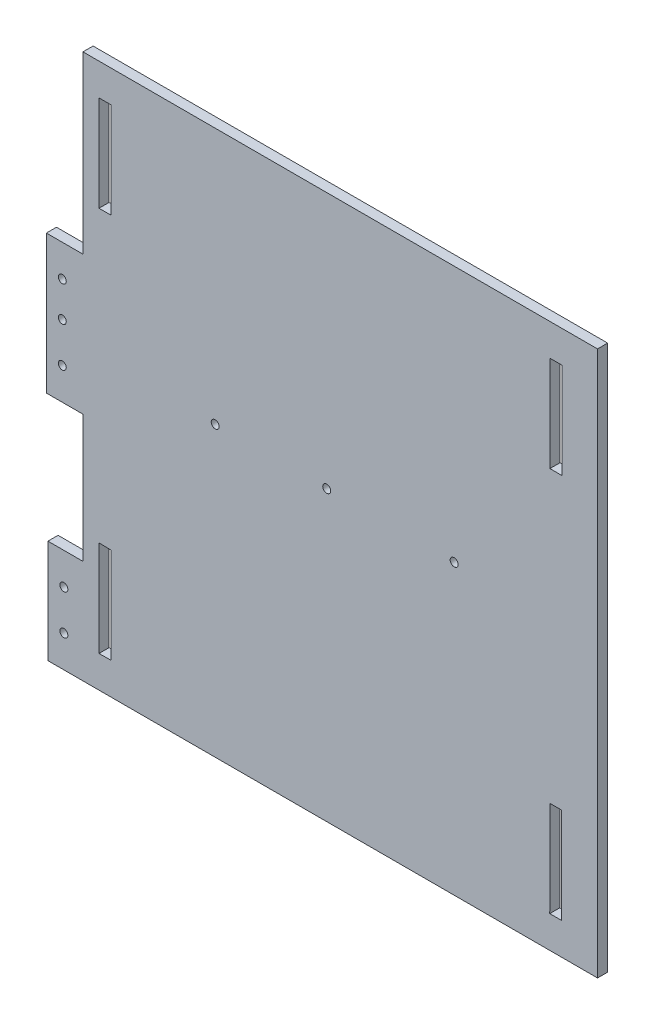
ISO-10303-21;
HEADER;
FILE_DESCRIPTION(('STEP AP214'),'2;1');
FILE_NAME('part.step','',(''),(''),'','','');
FILE_SCHEMA(('AUTOMOTIVE_DESIGN { 1 0 10303 214 1 1 1 1 }'));
ENDSEC;
DATA;
#1=APPLICATION_CONTEXT('core data for automotive mechanical design processes');
#2=APPLICATION_PROTOCOL_DEFINITION('international standard','automotive_design',2000,#1);
#3=PRODUCT_CONTEXT('',#1,'mechanical');
#4=PRODUCT('Part','Part','',(#3));
#5=PRODUCT_RELATED_PRODUCT_CATEGORY('part','',(#4));
#6=PRODUCT_DEFINITION_FORMATION('','',#4);
#7=PRODUCT_DEFINITION_CONTEXT('part definition',#1,'design');
#8=PRODUCT_DEFINITION('design','',#6,#7);
#9=PRODUCT_DEFINITION_SHAPE('','',#8);
#10=(LENGTH_UNIT() NAMED_UNIT(*) SI_UNIT(.MILLI.,.METRE.));
#11=(NAMED_UNIT(*) PLANE_ANGLE_UNIT() SI_UNIT($,.RADIAN.));
#12=(NAMED_UNIT(*) SI_UNIT($,.STERADIAN.) SOLID_ANGLE_UNIT());
#13=UNCERTAINTY_MEASURE_WITH_UNIT(LENGTH_MEASURE(1.E-05),#10,'distance_accuracy_value','');
#14=(GEOMETRIC_REPRESENTATION_CONTEXT(3) GLOBAL_UNCERTAINTY_ASSIGNED_CONTEXT((#13)) GLOBAL_UNIT_ASSIGNED_CONTEXT((#10,
#11,#12)) REPRESENTATION_CONTEXT('',''));
#15=CARTESIAN_POINT('',(0.,0.,0.));
#16=DIRECTION('',(0.,0.,1.));
#17=DIRECTION('',(1.,0.,0.));
#18=AXIS2_PLACEMENT_3D('',#15,#16,#17);
#19=CARTESIAN_POINT('',(691.84061693696,302.611489719056,-6.35));
#20=DIRECTION('',(1.,0.,0.));
#21=DIRECTION('',(0.,0.,-1.));
#22=AXIS2_PLACEMENT_3D('',#19,#20,#21);
#23=PLANE('',#22);
#24=DIRECTION('',(0.,1.,0.));
#25=VECTOR('',#24,1.);
#26=CARTESIAN_POINT('',(691.84061693696,302.611489719056,0.));
#27=LINE('',#26,#25);
#28=CARTESIAN_POINT('',(691.84061693696,302.611489719056,0.));
#29=VERTEX_POINT('',#28);
#30=CARTESIAN_POINT('',(691.84061693696,644.611489719056,0.));
#31=VERTEX_POINT('',#30);
#32=EDGE_CURVE('E388',#29,#31,#27,.T.);
#33=ORIENTED_EDGE('',*,*,#32,.F.);
#34=DIRECTION('',(0.,0.,1.));
#35=VECTOR('',#34,1.);
#36=CARTESIAN_POINT('',(691.84061693696,302.611489719056,-6.35));
#37=LINE('',#36,#35);
#38=CARTESIAN_POINT('',(691.84061693696,302.611489719056,-6.35));
#39=VERTEX_POINT('',#38);
#40=EDGE_CURVE('E11',#39,#29,#37,.T.);
#41=ORIENTED_EDGE('',*,*,#40,.F.);
#42=DIRECTION('',(0.,1.,0.));
#43=VECTOR('',#42,1.);
#44=CARTESIAN_POINT('',(691.84061693696,302.611489719056,-6.35));
#45=LINE('',#44,#43);
#46=CARTESIAN_POINT('',(691.84061693696,644.611489719056,-6.35));
#47=VERTEX_POINT('',#46);
#48=EDGE_CURVE('E391',#39,#47,#45,.T.);
#49=ORIENTED_EDGE('',*,*,#48,.T.);
#50=DIRECTION('',(0.,0.,1.));
#51=VECTOR('',#50,1.);
#52=CARTESIAN_POINT('',(691.84061693696,644.611489719056,-6.35));
#53=LINE('',#52,#51);
#54=EDGE_CURVE('E40',#47,#31,#53,.T.);
#55=ORIENTED_EDGE('',*,*,#54,.T.);
#56=EDGE_LOOP('',(#33,#41,#49,#55));
#57=FACE_BOUND('',#56,.T.);
#58=ADVANCED_FACE('F37',(#57),#23,.T.);
#59=CARTESIAN_POINT('',(691.84061693696,302.611489719056,-6.35));
#60=DIRECTION('',(0.,-1.,0.));
#61=DIRECTION('',(1.,0.,0.));
#62=AXIS2_PLACEMENT_3D('',#59,#60,#61);
#63=PLANE('',#62);
#64=DIRECTION('',(1.,0.,0.));
#65=VECTOR('',#64,1.);
#66=CARTESIAN_POINT('',(691.84061693696,302.611489719056,0.));
#67=LINE('',#66,#65);
#68=CARTESIAN_POINT('',(346.84061693696,302.611489719056,0.));
#69=VERTEX_POINT('',#68);
#70=EDGE_CURVE('E395',#69,#29,#67,.T.);
#71=ORIENTED_EDGE('',*,*,#70,.F.);
#72=DIRECTION('',(0.,0.,1.));
#73=VECTOR('',#72,1.);
#74=CARTESIAN_POINT('',(346.84061693696,302.611489719056,-6.35));
#75=LINE('',#74,#73);
#76=CARTESIAN_POINT('',(346.84061693696,302.611489719056,-6.35));
#77=VERTEX_POINT('',#76);
#78=EDGE_CURVE('E45',#77,#69,#75,.T.);
#79=ORIENTED_EDGE('',*,*,#78,.F.);
#80=DIRECTION('',(1.,0.,0.));
#81=VECTOR('',#80,1.);
#82=CARTESIAN_POINT('',(691.84061693696,302.611489719056,-6.35));
#83=LINE('',#82,#81);
#84=EDGE_CURVE('E419',#77,#39,#83,.T.);
#85=ORIENTED_EDGE('',*,*,#84,.T.);
#86=ORIENTED_EDGE('',*,*,#40,.T.);
#87=EDGE_LOOP('',(#71,#79,#85,#86));
#88=FACE_BOUND('',#87,.T.);
#89=ADVANCED_FACE('F476',(#88),#63,.T.);
#90=CARTESIAN_POINT('',(346.84061693696,302.611489719056,-6.35));
#91=DIRECTION('',(-1.,0.,0.));
#92=DIRECTION('',(0.,0.,1.));
#93=AXIS2_PLACEMENT_3D('',#90,#91,#92);
#94=PLANE('',#93);
#95=DIRECTION('',(0.,-1.,0.));
#96=VECTOR('',#95,1.);
#97=CARTESIAN_POINT('',(346.84061693696,302.611489719056,0.));
#98=LINE('',#97,#96);
#99=CARTESIAN_POINT('',(346.84061693696,367.611489719056,0.));
#100=VERTEX_POINT('',#99);
#101=EDGE_CURVE('E445',#100,#69,#98,.T.);
#102=ORIENTED_EDGE('',*,*,#101,.F.);
#103=DIRECTION('',(0.,0.,1.));
#104=VECTOR('',#103,1.);
#105=CARTESIAN_POINT('',(346.84061693696,367.611489719056,-6.35));
#106=LINE('',#105,#104);
#107=CARTESIAN_POINT('',(346.84061693696,367.611489719056,-6.35));
#108=VERTEX_POINT('',#107);
#109=EDGE_CURVE('E451',#108,#100,#106,.T.);
#110=ORIENTED_EDGE('',*,*,#109,.F.);
#111=DIRECTION('',(0.,-1.,0.));
#112=VECTOR('',#111,1.);
#113=CARTESIAN_POINT('',(346.84061693696,302.611489719056,-6.35));
#114=LINE('',#113,#112);
#115=EDGE_CURVE('E416',#108,#77,#114,.T.);
#116=ORIENTED_EDGE('',*,*,#115,.T.);
#117=ORIENTED_EDGE('',*,*,#78,.T.);
#118=EDGE_LOOP('',(#102,#110,#116,#117));
#119=FACE_BOUND('',#118,.T.);
#120=ADVANCED_FACE('F504',(#119),#94,.T.);
#121=CARTESIAN_POINT('',(346.84061693696,367.611489719056,-6.35));
#122=DIRECTION('',(0.,1.,0.));
#123=DIRECTION('',(-1.,0.,0.));
#124=AXIS2_PLACEMENT_3D('',#121,#122,#123);
#125=PLANE('',#124);
#126=DIRECTION('',(-1.,0.,0.));
#127=VECTOR('',#126,1.);
#128=CARTESIAN_POINT('',(346.84061693696,367.611489719056,0.));
#129=LINE('',#128,#127);
#130=CARTESIAN_POINT('',(368.84061693696,367.611489719056,0.));
#131=VERTEX_POINT('',#130);
#132=EDGE_CURVE('E442',#131,#100,#129,.T.);
#133=ORIENTED_EDGE('',*,*,#132,.F.);
#134=DIRECTION('',(0.,0.,1.));
#135=VECTOR('',#134,1.);
#136=CARTESIAN_POINT('',(368.84061693696,367.611489719056,-6.35));
#137=LINE('',#136,#135);
#138=CARTESIAN_POINT('',(368.84061693696,367.611489719056,-6.35));
#139=VERTEX_POINT('',#138);
#140=EDGE_CURVE('E453',#139,#131,#137,.T.);
#141=ORIENTED_EDGE('',*,*,#140,.F.);
#142=DIRECTION('',(-1.,0.,0.));
#143=VECTOR('',#142,1.);
#144=CARTESIAN_POINT('',(346.84061693696,367.611489719056,-6.35));
#145=LINE('',#144,#143);
#146=EDGE_CURVE('E413',#139,#108,#145,.T.);
#147=ORIENTED_EDGE('',*,*,#146,.T.);
#148=ORIENTED_EDGE('',*,*,#109,.T.);
#149=EDGE_LOOP('',(#133,#141,#147,#148));
#150=FACE_BOUND('',#149,.T.);
#151=ADVANCED_FACE('F502',(#150),#125,.T.);
#152=CARTESIAN_POINT('',(368.84061693696,447.611489719056,-6.35));
#153=DIRECTION('',(-1.,0.,0.));
#154=DIRECTION('',(0.,0.,1.));
#155=AXIS2_PLACEMENT_3D('',#152,#153,#154);
#156=PLANE('',#155);
#157=DIRECTION('',(0.,-1.,0.));
#158=VECTOR('',#157,1.);
#159=CARTESIAN_POINT('',(368.84061693696,447.611489719056,0.));
#160=LINE('',#159,#158);
#161=CARTESIAN_POINT('',(368.84061693696,447.611489719056,0.));
#162=VERTEX_POINT('',#161);
#163=EDGE_CURVE('E439',#162,#131,#160,.T.);
#164=ORIENTED_EDGE('',*,*,#163,.F.);
#165=DIRECTION('',(0.,0.,1.));
#166=VECTOR('',#165,1.);
#167=CARTESIAN_POINT('',(368.84061693696,447.611489719056,-6.35));
#168=LINE('',#167,#166);
#169=CARTESIAN_POINT('',(368.84061693696,447.611489719056,-6.35));
#170=VERTEX_POINT('',#169);
#171=EDGE_CURVE('E455',#170,#162,#168,.T.);
#172=ORIENTED_EDGE('',*,*,#171,.F.);
#173=DIRECTION('',(0.,-1.,0.));
#174=VECTOR('',#173,1.);
#175=CARTESIAN_POINT('',(368.84061693696,447.611489719056,-6.35));
#176=LINE('',#175,#174);
#177=EDGE_CURVE('E410',#170,#139,#176,.T.);
#178=ORIENTED_EDGE('',*,*,#177,.T.);
#179=ORIENTED_EDGE('',*,*,#140,.T.);
#180=EDGE_LOOP('',(#164,#172,#178,#179));
#181=FACE_BOUND('',#180,.T.);
#182=ADVANCED_FACE('F498',(#181),#156,.T.);
#183=CARTESIAN_POINT('',(368.84061693696,447.611489719056,-6.35));
#184=DIRECTION('',(0.,-1.,0.));
#185=DIRECTION('',(0.,0.,-1.));
#186=AXIS2_PLACEMENT_3D('',#183,#184,#185);
#187=PLANE('',#186);
#188=DIRECTION('',(1.,0.,0.));
#189=VECTOR('',#188,1.);
#190=CARTESIAN_POINT('',(368.84061693696,447.611489719056,0.));
#191=LINE('',#190,#189);
#192=CARTESIAN_POINT('',(345.84061693696,447.611489719056,0.));
#193=VERTEX_POINT('',#192);
#194=EDGE_CURVE('E436',#193,#162,#191,.T.);
#195=ORIENTED_EDGE('',*,*,#194,.F.);
#196=DIRECTION('',(0.,0.,1.));
#197=VECTOR('',#196,1.);
#198=CARTESIAN_POINT('',(345.84061693696,447.611489719056,-6.35));
#199=LINE('',#198,#197);
#200=CARTESIAN_POINT('',(345.84061693696,447.611489719056,-6.35));
#201=VERTEX_POINT('',#200);
#202=EDGE_CURVE('E457',#201,#193,#199,.T.);
#203=ORIENTED_EDGE('',*,*,#202,.F.);
#204=DIRECTION('',(1.,0.,0.));
#205=VECTOR('',#204,1.);
#206=CARTESIAN_POINT('',(368.84061693696,447.611489719056,-6.35));
#207=LINE('',#206,#205);
#208=EDGE_CURVE('E407',#201,#170,#207,.T.);
#209=ORIENTED_EDGE('',*,*,#208,.T.);
#210=ORIENTED_EDGE('',*,*,#171,.T.);
#211=EDGE_LOOP('',(#195,#203,#209,#210));
#212=FACE_BOUND('',#211,.T.);
#213=ADVANCED_FACE('F494',(#212),#187,.T.);
#214=CARTESIAN_POINT('',(345.84061693696,447.611489719056,-6.35));
#215=DIRECTION('',(-1.,0.,0.));
#216=DIRECTION('',(0.,0.,1.));
#217=AXIS2_PLACEMENT_3D('',#214,#215,#216);
#218=PLANE('',#217);
#219=DIRECTION('',(0.,-1.,0.));
#220=VECTOR('',#219,1.);
#221=CARTESIAN_POINT('',(345.84061693696,447.611489719056,0.));
#222=LINE('',#221,#220);
#223=CARTESIAN_POINT('',(345.84061693696,534.611489719056,0.));
#224=VERTEX_POINT('',#223);
#225=EDGE_CURVE('E433',#224,#193,#222,.T.);
#226=ORIENTED_EDGE('',*,*,#225,.F.);
#227=DIRECTION('',(0.,0.,1.));
#228=VECTOR('',#227,1.);
#229=CARTESIAN_POINT('',(345.84061693696,534.611489719056,-6.35));
#230=LINE('',#229,#228);
#231=CARTESIAN_POINT('',(345.84061693696,534.611489719056,-6.35));
#232=VERTEX_POINT('',#231);
#233=EDGE_CURVE('E459',#232,#224,#230,.T.);
#234=ORIENTED_EDGE('',*,*,#233,.F.);
#235=DIRECTION('',(0.,-1.,0.));
#236=VECTOR('',#235,1.);
#237=CARTESIAN_POINT('',(345.84061693696,447.611489719056,-6.35));
#238=LINE('',#237,#236);
#239=EDGE_CURVE('E404',#232,#201,#238,.T.);
#240=ORIENTED_EDGE('',*,*,#239,.T.);
#241=ORIENTED_EDGE('',*,*,#202,.T.);
#242=EDGE_LOOP('',(#226,#234,#240,#241));
#243=FACE_BOUND('',#242,.T.);
#244=ADVANCED_FACE('F490',(#243),#218,.T.);
#245=CARTESIAN_POINT('',(345.84061693696,534.611489719056,-6.35));
#246=DIRECTION('',(0.,1.,0.));
#247=DIRECTION('',(-1.,0.,0.));
#248=AXIS2_PLACEMENT_3D('',#245,#246,#247);
#249=PLANE('',#248);
#250=DIRECTION('',(-1.,0.,0.));
#251=VECTOR('',#250,1.);
#252=CARTESIAN_POINT('',(345.84061693696,534.611489719056,0.));
#253=LINE('',#252,#251);
#254=CARTESIAN_POINT('',(368.84061693696,534.611489719056,0.));
#255=VERTEX_POINT('',#254);
#256=EDGE_CURVE('E430',#255,#224,#253,.T.);
#257=ORIENTED_EDGE('',*,*,#256,.F.);
#258=DIRECTION('',(0.,0.,1.));
#259=VECTOR('',#258,1.);
#260=CARTESIAN_POINT('',(368.84061693696,534.611489719056,-6.35));
#261=LINE('',#260,#259);
#262=CARTESIAN_POINT('',(368.84061693696,534.611489719056,-6.35));
#263=VERTEX_POINT('',#262);
#264=EDGE_CURVE('E461',#263,#255,#261,.T.);
#265=ORIENTED_EDGE('',*,*,#264,.F.);
#266=DIRECTION('',(-1.,0.,0.));
#267=VECTOR('',#266,1.);
#268=CARTESIAN_POINT('',(345.84061693696,534.611489719056,-6.35));
#269=LINE('',#268,#267);
#270=EDGE_CURVE('E401',#263,#232,#269,.T.);
#271=ORIENTED_EDGE('',*,*,#270,.T.);
#272=ORIENTED_EDGE('',*,*,#233,.T.);
#273=EDGE_LOOP('',(#257,#265,#271,#272));
#274=FACE_BOUND('',#273,.T.);
#275=ADVANCED_FACE('F488',(#274),#249,.T.);
#276=CARTESIAN_POINT('',(368.84061693696,644.611489719056,-6.35));
#277=DIRECTION('',(-1.,0.,0.));
#278=DIRECTION('',(0.,0.,1.));
#279=AXIS2_PLACEMENT_3D('',#276,#277,#278);
#280=PLANE('',#279);
#281=DIRECTION('',(0.,-1.,0.));
#282=VECTOR('',#281,1.);
#283=CARTESIAN_POINT('',(368.84061693696,644.611489719056,0.));
#284=LINE('',#283,#282);
#285=CARTESIAN_POINT('',(368.84061693696,644.611489719056,0.));
#286=VERTEX_POINT('',#285);
#287=EDGE_CURVE('E427',#286,#255,#284,.T.);
#288=ORIENTED_EDGE('',*,*,#287,.F.);
#289=DIRECTION('',(0.,0.,1.));
#290=VECTOR('',#289,1.);
#291=CARTESIAN_POINT('',(368.84061693696,644.611489719056,-6.35));
#292=LINE('',#291,#290);
#293=CARTESIAN_POINT('',(368.84061693696,644.611489719056,-6.35));
#294=VERTEX_POINT('',#293);
#295=EDGE_CURVE('E462',#294,#286,#292,.T.);
#296=ORIENTED_EDGE('',*,*,#295,.F.);
#297=DIRECTION('',(0.,-1.,0.));
#298=VECTOR('',#297,1.);
#299=CARTESIAN_POINT('',(368.84061693696,644.611489719056,-6.35));
#300=LINE('',#299,#298);
#301=EDGE_CURVE('E398',#294,#263,#300,.T.);
#302=ORIENTED_EDGE('',*,*,#301,.T.);
#303=ORIENTED_EDGE('',*,*,#264,.T.);
#304=EDGE_LOOP('',(#288,#296,#302,#303));
#305=FACE_BOUND('',#304,.T.);
#306=ADVANCED_FACE('F484',(#305),#280,.T.);
#307=CARTESIAN_POINT('',(691.84061693696,644.611489719056,-6.35));
#308=DIRECTION('',(0.,1.,0.));
#309=DIRECTION('',(-1.,0.,0.));
#310=AXIS2_PLACEMENT_3D('',#307,#308,#309);
#311=PLANE('',#310);
#312=DIRECTION('',(-1.,0.,0.));
#313=VECTOR('',#312,1.);
#314=CARTESIAN_POINT('',(691.84061693696,644.611489719056,0.));
#315=LINE('',#314,#313);
#316=EDGE_CURVE('E424',#31,#286,#315,.T.);
#317=ORIENTED_EDGE('',*,*,#316,.F.);
#318=ORIENTED_EDGE('',*,*,#54,.F.);
#319=DIRECTION('',(-1.,0.,0.));
#320=VECTOR('',#319,1.);
#321=CARTESIAN_POINT('',(691.84061693696,644.611489719056,-6.35));
#322=LINE('',#321,#320);
#323=EDGE_CURVE('E394',#47,#294,#322,.T.);
#324=ORIENTED_EDGE('',*,*,#323,.T.);
#325=ORIENTED_EDGE('',*,*,#295,.T.);
#326=EDGE_LOOP('',(#317,#318,#324,#325));
#327=FACE_BOUND('',#326,.T.);
#328=ADVANCED_FACE('F470',(#327),#311,.T.);
#329=CARTESIAN_POINT('',(0.,0.,-6.35));
#330=DIRECTION('',(0.,0.,1.));
#331=DIRECTION('',(1.,0.,0.));
#332=AXIS2_PLACEMENT_3D('',#329,#330,#331);
#333=PLANE('',#332);
#334=DIRECTION('',(-0.999999889161753,0.00047082531897426,0.));
#335=VECTOR('',#334,1.);
#336=CARTESIAN_POINT('',(661.873375205945,382.61477007323,-6.35));
#337=LINE('',#336,#335);
#338=CARTESIAN_POINT('',(669.373373543371,382.611238883729,-6.35));
#339=VERTEX_POINT('',#338);
#340=CARTESIAN_POINT('',(661.873375205945,382.61477007323,-6.35));
#341=VERTEX_POINT('',#340);
#342=EDGE_CURVE('E218',#339,#341,#337,.T.);
#343=ORIENTED_EDGE('',*,*,#342,.T.);
#344=DIRECTION('',(-0.000470825318972987,-0.999999889161753,0.));
#345=VECTOR('',#344,1.);
#346=CARTESIAN_POINT('',(661.845125686806,322.614776723525,-6.35));
#347=LINE('',#346,#345);
#348=CARTESIAN_POINT('',(661.845125686806,322.614776723525,-6.35));
#349=VERTEX_POINT('',#348);
#350=EDGE_CURVE('E212',#341,#349,#347,.T.);
#351=ORIENTED_EDGE('',*,*,#350,.T.);
#352=DIRECTION('',(0.999999889161753,-0.000470825318981655,0.));
#353=VECTOR('',#352,1.);
#354=CARTESIAN_POINT('',(669.345124024233,322.611245534024,-6.35));
#355=LINE('',#354,#353);
#356=CARTESIAN_POINT('',(669.345124024233,322.611245534024,-6.35));
#357=VERTEX_POINT('',#356);
#358=EDGE_CURVE('E221',#349,#357,#355,.T.);
#359=ORIENTED_EDGE('',*,*,#358,.T.);
#360=DIRECTION('',(0.000470825318971136,0.999999889161753,0.));
#361=VECTOR('',#360,1.);
#362=CARTESIAN_POINT('',(669.373373543371,382.611238883729,-6.35));
#363=LINE('',#362,#361);
#364=EDGE_CURVE('E53',#357,#339,#363,.T.);
#365=ORIENTED_EDGE('',*,*,#364,.T.);
#366=EDGE_LOOP('',(#343,#351,#359,#365));
#367=FACE_BOUND('',#366,.T.);
#368=DIRECTION('',(-1.,0.,0.));
#369=VECTOR('',#368,1.);
#370=CARTESIAN_POINT('',(661.987313401291,624.611489719056,-6.35));
#371=LINE('',#370,#369);
#372=CARTESIAN_POINT('',(669.487313401291,624.611489719056,-6.35));
#373=VERTEX_POINT('',#372);
#374=CARTESIAN_POINT('',(661.987313401291,624.611489719056,-6.35));
#375=VERTEX_POINT('',#374);
#376=EDGE_CURVE('E257',#373,#375,#371,.T.);
#377=ORIENTED_EDGE('',*,*,#376,.T.);
#378=DIRECTION('',(-0.000470825318969859,-0.999999889161753,0.));
#379=VECTOR('',#378,1.);
#380=CARTESIAN_POINT('',(661.959063879021,564.611489719056,-6.35));
#381=LINE('',#380,#379);
#382=CARTESIAN_POINT('',(661.959063879021,564.611489719056,-6.35));
#383=VERTEX_POINT('',#382);
#384=EDGE_CURVE('E247',#375,#383,#381,.T.);
#385=ORIENTED_EDGE('',*,*,#384,.T.);
#386=DIRECTION('',(1.,0.,0.));
#387=VECTOR('',#386,1.);
#388=CARTESIAN_POINT('',(669.459063879021,564.611489719056,-6.35));
#389=LINE('',#388,#387);
#390=CARTESIAN_POINT('',(669.459063879021,564.611489719056,-6.35));
#391=VERTEX_POINT('',#390);
#392=EDGE_CURVE('E250',#383,#391,#389,.T.);
#393=ORIENTED_EDGE('',*,*,#392,.T.);
#394=DIRECTION('',(0.00047082531897171,0.999999889161753,0.));
#395=VECTOR('',#394,1.);
#396=CARTESIAN_POINT('',(669.487313401291,624.611489719056,-6.35));
#397=LINE('',#396,#395);
#398=EDGE_CURVE('E254',#391,#373,#397,.T.);
#399=ORIENTED_EDGE('',*,*,#398,.T.);
#400=EDGE_LOOP('',(#377,#385,#393,#399));
#401=FACE_BOUND('',#400,.T.);
#402=DIRECTION('',(-0.999835125332656,0.0181582529729995,0.));
#403=VECTOR('',#402,1.);
#404=CARTESIAN_POINT('',(378.87824937939,382.675054084634,-6.35));
#405=LINE('',#404,#403);
#406=CARTESIAN_POINT('',(386.377012819385,382.538867187337,-6.35));
#407=VERTEX_POINT('',#406);
#408=CARTESIAN_POINT('',(378.87824937939,382.675054084634,-6.35));
#409=VERTEX_POINT('',#408);
#410=EDGE_CURVE('E289',#407,#409,#405,.T.);
#411=ORIENTED_EDGE('',*,*,#410,.T.);
#412=DIRECTION('',(0.,-1.,0.));
#413=VECTOR('',#412,1.);
#414=CARTESIAN_POINT('',(378.87824937939,322.547926114496,-6.35));
#415=LINE('',#414,#413);
#416=CARTESIAN_POINT('',(378.87824937939,322.547926114496,-6.35));
#417=VERTEX_POINT('',#416);
#418=EDGE_CURVE('E279',#409,#417,#415,.T.);
#419=ORIENTED_EDGE('',*,*,#418,.T.);
#420=DIRECTION('',(0.999936252296057,0.0112912064951837,0.));
#421=VECTOR('',#420,1.);
#422=CARTESIAN_POINT('',(386.377012819385,322.632601598823,-6.35));
#423=LINE('',#422,#421);
#424=CARTESIAN_POINT('',(386.377012819385,322.632601598823,-6.35));
#425=VERTEX_POINT('',#424);
#426=EDGE_CURVE('E282',#417,#425,#423,.T.);
#427=ORIENTED_EDGE('',*,*,#426,.T.);
#428=DIRECTION('',(0.,1.,0.));
#429=VECTOR('',#428,1.);
#430=CARTESIAN_POINT('',(386.377012819385,382.538867187337,-6.35));
#431=LINE('',#430,#429);
#432=EDGE_CURVE('E286',#425,#407,#431,.T.);
#433=ORIENTED_EDGE('',*,*,#432,.T.);
#434=EDGE_LOOP('',(#411,#419,#427,#433));
#435=FACE_BOUND('',#434,.T.);
#436=DIRECTION('',(-1.,0.,0.));
#437=VECTOR('',#436,1.);
#438=CARTESIAN_POINT('',(378.87824937939,624.607057398581,-6.35));
#439=LINE('',#438,#437);
#440=CARTESIAN_POINT('',(386.37824937939,624.607057398581,-6.35));
#441=VERTEX_POINT('',#440);
#442=CARTESIAN_POINT('',(378.87824937939,624.607057398581,-6.35));
#443=VERTEX_POINT('',#442);
#444=EDGE_CURVE('E321',#441,#443,#439,.T.);
#445=ORIENTED_EDGE('',*,*,#444,.T.);
#446=DIRECTION('',(0.,-1.,0.));
#447=VECTOR('',#446,1.);
#448=CARTESIAN_POINT('',(378.87824937939,564.607045370741,-6.35));
#449=LINE('',#448,#447);
#450=CARTESIAN_POINT('',(378.87824937939,564.607045370741,-6.35));
#451=VERTEX_POINT('',#450);
#452=EDGE_CURVE('E311',#443,#451,#449,.T.);
#453=ORIENTED_EDGE('',*,*,#452,.T.);
#454=DIRECTION('',(1.,0.,0.));
#455=VECTOR('',#454,1.);
#456=CARTESIAN_POINT('',(386.37824937939,564.607045370741,-6.35));
#457=LINE('',#456,#455);
#458=CARTESIAN_POINT('',(386.37824937939,564.607045370741,-6.35));
#459=VERTEX_POINT('',#458);
#460=EDGE_CURVE('E314',#451,#459,#457,.T.);
#461=ORIENTED_EDGE('',*,*,#460,.T.);
#462=DIRECTION('',(0.,1.,0.));
#463=VECTOR('',#462,1.);
#464=CARTESIAN_POINT('',(386.37824937939,624.607057398581,-6.35));
#465=LINE('',#464,#463);
#466=EDGE_CURVE('E318',#459,#441,#465,.T.);
#467=ORIENTED_EDGE('',*,*,#466,.T.);
#468=EDGE_LOOP('',(#445,#453,#461,#467));
#469=FACE_BOUND('',#468,.T.);
#470=CARTESIAN_POINT('',(601.84061693696,483.611489719056,-6.35));
#471=DIRECTION('',(0.,0.,1.));
#472=DIRECTION('',(1.,0.,0.));
#473=AXIS2_PLACEMENT_3D('',#470,#471,#472);
#474=CIRCLE('',#473,2.49999999999984);
#475=CARTESIAN_POINT('',(604.340616936959,483.611489719056,-6.35));
#476=VERTEX_POINT('',#475);
#477=EDGE_CURVE('E343',#476,#476,#474,.T.);
#478=ORIENTED_EDGE('',*,*,#477,.T.);
#479=EDGE_LOOP('',(#478));
#480=FACE_BOUND('',#479,.T.);
#481=CARTESIAN_POINT('',(521.84061693696,483.611489719056,-6.35));
#482=DIRECTION('',(0.,0.,1.));
#483=DIRECTION('',(1.,0.,0.));
#484=AXIS2_PLACEMENT_3D('',#481,#482,#483);
#485=CIRCLE('',#484,2.49999999999995);
#486=CARTESIAN_POINT('',(524.34061693696,483.611489719056,-6.35));
#487=VERTEX_POINT('',#486);
#488=EDGE_CURVE('E349',#487,#487,#485,.T.);
#489=ORIENTED_EDGE('',*,*,#488,.T.);
#490=EDGE_LOOP('',(#489));
#491=FACE_BOUND('',#490,.T.);
#492=CARTESIAN_POINT('',(451.84061693696,483.611489719056,-6.35));
#493=DIRECTION('',(0.,0.,1.));
#494=DIRECTION('',(1.,0.,0.));
#495=AXIS2_PLACEMENT_3D('',#492,#493,#494);
#496=CIRCLE('',#495,2.5);
#497=CARTESIAN_POINT('',(454.34061693696,483.611489719056,-6.35));
#498=VERTEX_POINT('',#497);
#499=EDGE_CURVE('E355',#498,#498,#496,.T.);
#500=ORIENTED_EDGE('',*,*,#499,.T.);
#501=EDGE_LOOP('',(#500));
#502=FACE_BOUND('',#501,.T.);
#503=CARTESIAN_POINT('',(356.84061693696,322.611489719056,-6.35));
#504=DIRECTION('',(0.,0.,1.));
#505=DIRECTION('',(1.,0.,0.));
#506=AXIS2_PLACEMENT_3D('',#503,#504,#505);
#507=CIRCLE('',#506,2.5);
#508=CARTESIAN_POINT('',(359.34061693696,322.611489719056,-6.35));
#509=VERTEX_POINT('',#508);
#510=EDGE_CURVE('E361',#509,#509,#507,.T.);
#511=ORIENTED_EDGE('',*,*,#510,.T.);
#512=EDGE_LOOP('',(#511));
#513=FACE_BOUND('',#512,.T.);
#514=CARTESIAN_POINT('',(356.84061693696,347.611489719056,-6.35));
#515=DIRECTION('',(0.,0.,1.));
#516=DIRECTION('',(1.,0.,0.));
#517=AXIS2_PLACEMENT_3D('',#514,#515,#516);
#518=CIRCLE('',#517,2.5);
#519=CARTESIAN_POINT('',(359.34061693696,347.611489719056,-6.35));
#520=VERTEX_POINT('',#519);
#521=EDGE_CURVE('E367',#520,#520,#518,.T.);
#522=ORIENTED_EDGE('',*,*,#521,.T.);
#523=EDGE_LOOP('',(#522));
#524=FACE_BOUND('',#523,.T.);
#525=CARTESIAN_POINT('',(355.84061693696,467.611489719056,-6.35));
#526=DIRECTION('',(0.,0.,1.));
#527=DIRECTION('',(1.,0.,0.));
#528=AXIS2_PLACEMENT_3D('',#525,#526,#527);
#529=CIRCLE('',#528,2.5);
#530=CARTESIAN_POINT('',(358.34061693696,467.611489719056,-6.35));
#531=VERTEX_POINT('',#530);
#532=EDGE_CURVE('E373',#531,#531,#529,.T.);
#533=ORIENTED_EDGE('',*,*,#532,.T.);
#534=EDGE_LOOP('',(#533));
#535=FACE_BOUND('',#534,.T.);
#536=CARTESIAN_POINT('',(355.84061693696,492.611489719056,-6.35));
#537=DIRECTION('',(0.,0.,1.));
#538=DIRECTION('',(1.,0.,0.));
#539=AXIS2_PLACEMENT_3D('',#536,#537,#538);
#540=CIRCLE('',#539,2.5);
#541=CARTESIAN_POINT('',(358.34061693696,492.611489719056,-6.35));
#542=VERTEX_POINT('',#541);
#543=EDGE_CURVE('E379',#542,#542,#540,.T.);
#544=ORIENTED_EDGE('',*,*,#543,.T.);
#545=EDGE_LOOP('',(#544));
#546=FACE_BOUND('',#545,.T.);
#547=CARTESIAN_POINT('',(355.84061693696,514.611489719056,-6.35));
#548=DIRECTION('',(0.,0.,1.));
#549=DIRECTION('',(1.,0.,0.));
#550=AXIS2_PLACEMENT_3D('',#547,#548,#549);
#551=CIRCLE('',#550,2.5);
#552=CARTESIAN_POINT('',(358.34061693696,514.611489719056,-6.35));
#553=VERTEX_POINT('',#552);
#554=EDGE_CURVE('E385',#553,#553,#551,.T.);
#555=ORIENTED_EDGE('',*,*,#554,.T.);
#556=EDGE_LOOP('',(#555));
#557=FACE_BOUND('',#556,.T.);
#558=ORIENTED_EDGE('',*,*,#48,.F.);
#559=ORIENTED_EDGE('',*,*,#84,.F.);
#560=ORIENTED_EDGE('',*,*,#115,.F.);
#561=ORIENTED_EDGE('',*,*,#146,.F.);
#562=ORIENTED_EDGE('',*,*,#177,.F.);
#563=ORIENTED_EDGE('',*,*,#208,.F.);
#564=ORIENTED_EDGE('',*,*,#239,.F.);
#565=ORIENTED_EDGE('',*,*,#270,.F.);
#566=ORIENTED_EDGE('',*,*,#301,.F.);
#567=ORIENTED_EDGE('',*,*,#323,.F.);
#568=EDGE_LOOP('',(#558,#559,#560,#561,#562,#563,#564,#565,#566,#567));
#569=FACE_BOUND('',#568,.T.);
#570=ADVANCED_FACE('F225',(#367,#401,#435,#469,#480,#491,#502,#513,#524,#535,#546,#557,#569),
#333,.F.);
#571=CARTESIAN_POINT('',(0.,0.,0.));
#572=DIRECTION('',(0.,0.,1.));
#573=DIRECTION('',(1.,0.,0.));
#574=AXIS2_PLACEMENT_3D('',#571,#572,#573);
#575=PLANE('',#574);
#576=DIRECTION('',(-0.000470825318972987,-0.999999889161753,0.));
#577=VECTOR('',#576,1.);
#578=CARTESIAN_POINT('',(661.845125686806,322.614776723525,0.));
#579=LINE('',#578,#577);
#580=CARTESIAN_POINT('',(661.873375205945,382.61477007323,0.));
#581=VERTEX_POINT('',#580);
#582=CARTESIAN_POINT('',(661.845125686806,322.614776723525,0.));
#583=VERTEX_POINT('',#582);
#584=EDGE_CURVE('E61',#581,#583,#579,.T.);
#585=ORIENTED_EDGE('',*,*,#584,.F.);
#586=DIRECTION('',(-0.999999889161753,0.00047082531897426,0.));
#587=VECTOR('',#586,1.);
#588=CARTESIAN_POINT('',(661.873375205945,382.61477007323,0.));
#589=LINE('',#588,#587);
#590=CARTESIAN_POINT('',(669.373373543371,382.611238883729,0.));
#591=VERTEX_POINT('',#590);
#592=EDGE_CURVE('E228',#591,#581,#589,.T.);
#593=ORIENTED_EDGE('',*,*,#592,.F.);
#594=DIRECTION('',(0.000470825318971136,0.999999889161753,0.));
#595=VECTOR('',#594,1.);
#596=CARTESIAN_POINT('',(669.373373543371,382.611238883729,0.));
#597=LINE('',#596,#595);
#598=CARTESIAN_POINT('',(669.345124024233,322.611245534024,0.));
#599=VERTEX_POINT('',#598);
#600=EDGE_CURVE('E231',#599,#591,#597,.T.);
#601=ORIENTED_EDGE('',*,*,#600,.F.);
#602=DIRECTION('',(0.999999889161753,-0.000470825318981655,0.));
#603=VECTOR('',#602,1.);
#604=CARTESIAN_POINT('',(669.345124024233,322.611245534024,0.));
#605=LINE('',#604,#603);
#606=EDGE_CURVE('E237',#583,#599,#605,.T.);
#607=ORIENTED_EDGE('',*,*,#606,.F.);
#608=EDGE_LOOP('',(#585,#593,#601,#607));
#609=FACE_BOUND('',#608,.T.);
#610=DIRECTION('',(-0.000470825318969859,-0.999999889161753,0.));
#611=VECTOR('',#610,1.);
#612=CARTESIAN_POINT('',(661.959063879021,564.611489719056,0.));
#613=LINE('',#612,#611);
#614=CARTESIAN_POINT('',(661.987313401291,624.611489719056,0.));
#615=VERTEX_POINT('',#614);
#616=CARTESIAN_POINT('',(661.959063879021,564.611489719056,0.));
#617=VERTEX_POINT('',#616);
#618=EDGE_CURVE('E243',#615,#617,#613,.T.);
#619=ORIENTED_EDGE('',*,*,#618,.F.);
#620=DIRECTION('',(-1.,0.,0.));
#621=VECTOR('',#620,1.);
#622=CARTESIAN_POINT('',(661.987313401291,624.611489719056,0.));
#623=LINE('',#622,#621);
#624=CARTESIAN_POINT('',(669.487313401291,624.611489719056,0.));
#625=VERTEX_POINT('',#624);
#626=EDGE_CURVE('E251',#625,#615,#623,.T.);
#627=ORIENTED_EDGE('',*,*,#626,.F.);
#628=DIRECTION('',(0.00047082531897171,0.999999889161753,0.));
#629=VECTOR('',#628,1.);
#630=CARTESIAN_POINT('',(669.487313401291,624.611489719056,0.));
#631=LINE('',#630,#629);
#632=CARTESIAN_POINT('',(669.459063879021,564.611489719056,0.));
#633=VERTEX_POINT('',#632);
#634=EDGE_CURVE('E265',#633,#625,#631,.T.);
#635=ORIENTED_EDGE('',*,*,#634,.F.);
#636=DIRECTION('',(1.,0.,0.));
#637=VECTOR('',#636,1.);
#638=CARTESIAN_POINT('',(669.459063879021,564.611489719056,0.));
#639=LINE('',#638,#637);
#640=EDGE_CURVE('E262',#617,#633,#639,.T.);
#641=ORIENTED_EDGE('',*,*,#640,.F.);
#642=EDGE_LOOP('',(#619,#627,#635,#641));
#643=FACE_BOUND('',#642,.T.);
#644=DIRECTION('',(0.,-1.,0.));
#645=VECTOR('',#644,1.);
#646=CARTESIAN_POINT('',(378.87824937939,322.547926114496,0.));
#647=LINE('',#646,#645);
#648=CARTESIAN_POINT('',(378.87824937939,382.675054084634,0.));
#649=VERTEX_POINT('',#648);
#650=CARTESIAN_POINT('',(378.87824937939,322.547926114496,0.));
#651=VERTEX_POINT('',#650);
#652=EDGE_CURVE('E272',#649,#651,#647,.T.);
#653=ORIENTED_EDGE('',*,*,#652,.F.);
#654=DIRECTION('',(-0.999835125332656,0.0181582529729995,0.));
#655=VECTOR('',#654,1.);
#656=CARTESIAN_POINT('',(378.87824937939,382.675054084634,0.));
#657=LINE('',#656,#655);
#658=CARTESIAN_POINT('',(386.377012819385,382.538867187337,0.));
#659=VERTEX_POINT('',#658);
#660=EDGE_CURVE('E283',#659,#649,#657,.T.);
#661=ORIENTED_EDGE('',*,*,#660,.F.);
#662=DIRECTION('',(0.,1.,0.));
#663=VECTOR('',#662,1.);
#664=CARTESIAN_POINT('',(386.377012819385,382.538867187337,0.));
#665=LINE('',#664,#663);
#666=CARTESIAN_POINT('',(386.377012819385,322.632601598823,0.));
#667=VERTEX_POINT('',#666);
#668=EDGE_CURVE('E297',#667,#659,#665,.T.);
#669=ORIENTED_EDGE('',*,*,#668,.F.);
#670=DIRECTION('',(0.999936252296057,0.0112912064951837,0.));
#671=VECTOR('',#670,1.);
#672=CARTESIAN_POINT('',(386.377012819385,322.632601598823,0.));
#673=LINE('',#672,#671);
#674=EDGE_CURVE('E294',#651,#667,#673,.T.);
#675=ORIENTED_EDGE('',*,*,#674,.F.);
#676=EDGE_LOOP('',(#653,#661,#669,#675));
#677=FACE_BOUND('',#676,.T.);
#678=DIRECTION('',(0.,-1.,0.));
#679=VECTOR('',#678,1.);
#680=CARTESIAN_POINT('',(378.87824937939,564.607045370741,0.));
#681=LINE('',#680,#679);
#682=CARTESIAN_POINT('',(378.87824937939,624.607057398581,0.));
#683=VERTEX_POINT('',#682);
#684=CARTESIAN_POINT('',(378.87824937939,564.607045370741,0.));
#685=VERTEX_POINT('',#684);
#686=EDGE_CURVE('E304',#683,#685,#681,.T.);
#687=ORIENTED_EDGE('',*,*,#686,.F.);
#688=DIRECTION('',(-1.,0.,0.));
#689=VECTOR('',#688,1.);
#690=CARTESIAN_POINT('',(378.87824937939,624.607057398581,0.));
#691=LINE('',#690,#689);
#692=CARTESIAN_POINT('',(386.37824937939,624.607057398581,0.));
#693=VERTEX_POINT('',#692);
#694=EDGE_CURVE('E315',#693,#683,#691,.T.);
#695=ORIENTED_EDGE('',*,*,#694,.F.);
#696=DIRECTION('',(0.,1.,0.));
#697=VECTOR('',#696,1.);
#698=CARTESIAN_POINT('',(386.37824937939,624.607057398581,0.));
#699=LINE('',#698,#697);
#700=CARTESIAN_POINT('',(386.37824937939,564.607045370741,0.));
#701=VERTEX_POINT('',#700);
#702=EDGE_CURVE('E329',#701,#693,#699,.T.);
#703=ORIENTED_EDGE('',*,*,#702,.F.);
#704=DIRECTION('',(1.,0.,0.));
#705=VECTOR('',#704,1.);
#706=CARTESIAN_POINT('',(386.37824937939,564.607045370741,0.));
#707=LINE('',#706,#705);
#708=EDGE_CURVE('E326',#685,#701,#707,.T.);
#709=ORIENTED_EDGE('',*,*,#708,.F.);
#710=EDGE_LOOP('',(#687,#695,#703,#709));
#711=FACE_BOUND('',#710,.T.);
#712=CARTESIAN_POINT('',(601.84061693696,483.611489719056,0.));
#713=DIRECTION('',(0.,0.,1.));
#714=DIRECTION('',(1.,0.,0.));
#715=AXIS2_PLACEMENT_3D('',#712,#713,#714);
#716=CIRCLE('',#715,2.49999999999984);
#717=CARTESIAN_POINT('',(604.340616936959,483.611489719056,0.));
#718=VERTEX_POINT('',#717);
#719=EDGE_CURVE('E336',#718,#718,#716,.T.);
#720=ORIENTED_EDGE('',*,*,#719,.F.);
#721=EDGE_LOOP('',(#720));
#722=FACE_BOUND('',#721,.T.);
#723=CARTESIAN_POINT('',(521.84061693696,483.611489719056,0.));
#724=DIRECTION('',(0.,0.,1.));
#725=DIRECTION('',(1.,0.,0.));
#726=AXIS2_PLACEMENT_3D('',#723,#724,#725);
#727=CIRCLE('',#726,2.49999999999995);
#728=CARTESIAN_POINT('',(524.34061693696,483.611489719056,0.));
#729=VERTEX_POINT('',#728);
#730=EDGE_CURVE('E346',#729,#729,#727,.T.);
#731=ORIENTED_EDGE('',*,*,#730,.F.);
#732=EDGE_LOOP('',(#731));
#733=FACE_BOUND('',#732,.T.);
#734=CARTESIAN_POINT('',(451.84061693696,483.611489719056,0.));
#735=DIRECTION('',(0.,0.,1.));
#736=DIRECTION('',(1.,0.,0.));
#737=AXIS2_PLACEMENT_3D('',#734,#735,#736);
#738=CIRCLE('',#737,2.5);
#739=CARTESIAN_POINT('',(454.34061693696,483.611489719056,0.));
#740=VERTEX_POINT('',#739);
#741=EDGE_CURVE('E352',#740,#740,#738,.T.);
#742=ORIENTED_EDGE('',*,*,#741,.F.);
#743=EDGE_LOOP('',(#742));
#744=FACE_BOUND('',#743,.T.);
#745=CARTESIAN_POINT('',(356.84061693696,322.611489719056,0.));
#746=DIRECTION('',(0.,0.,1.));
#747=DIRECTION('',(1.,0.,0.));
#748=AXIS2_PLACEMENT_3D('',#745,#746,#747);
#749=CIRCLE('',#748,2.5);
#750=CARTESIAN_POINT('',(359.34061693696,322.611489719056,0.));
#751=VERTEX_POINT('',#750);
#752=EDGE_CURVE('E358',#751,#751,#749,.T.);
#753=ORIENTED_EDGE('',*,*,#752,.F.);
#754=EDGE_LOOP('',(#753));
#755=FACE_BOUND('',#754,.T.);
#756=CARTESIAN_POINT('',(356.84061693696,347.611489719056,0.));
#757=DIRECTION('',(0.,0.,1.));
#758=DIRECTION('',(1.,0.,0.));
#759=AXIS2_PLACEMENT_3D('',#756,#757,#758);
#760=CIRCLE('',#759,2.5);
#761=CARTESIAN_POINT('',(359.34061693696,347.611489719056,0.));
#762=VERTEX_POINT('',#761);
#763=EDGE_CURVE('E364',#762,#762,#760,.T.);
#764=ORIENTED_EDGE('',*,*,#763,.F.);
#765=EDGE_LOOP('',(#764));
#766=FACE_BOUND('',#765,.T.);
#767=CARTESIAN_POINT('',(355.84061693696,467.611489719056,0.));
#768=DIRECTION('',(0.,0.,1.));
#769=DIRECTION('',(1.,0.,0.));
#770=AXIS2_PLACEMENT_3D('',#767,#768,#769);
#771=CIRCLE('',#770,2.5);
#772=CARTESIAN_POINT('',(358.34061693696,467.611489719056,0.));
#773=VERTEX_POINT('',#772);
#774=EDGE_CURVE('E370',#773,#773,#771,.T.);
#775=ORIENTED_EDGE('',*,*,#774,.F.);
#776=EDGE_LOOP('',(#775));
#777=FACE_BOUND('',#776,.T.);
#778=CARTESIAN_POINT('',(355.84061693696,492.611489719056,0.));
#779=DIRECTION('',(0.,0.,1.));
#780=DIRECTION('',(1.,0.,0.));
#781=AXIS2_PLACEMENT_3D('',#778,#779,#780);
#782=CIRCLE('',#781,2.5);
#783=CARTESIAN_POINT('',(358.34061693696,492.611489719056,0.));
#784=VERTEX_POINT('',#783);
#785=EDGE_CURVE('E376',#784,#784,#782,.T.);
#786=ORIENTED_EDGE('',*,*,#785,.F.);
#787=EDGE_LOOP('',(#786));
#788=FACE_BOUND('',#787,.T.);
#789=CARTESIAN_POINT('',(355.84061693696,514.611489719056,0.));
#790=DIRECTION('',(0.,0.,1.));
#791=DIRECTION('',(1.,0.,0.));
#792=AXIS2_PLACEMENT_3D('',#789,#790,#791);
#793=CIRCLE('',#792,2.5);
#794=CARTESIAN_POINT('',(358.34061693696,514.611489719056,0.));
#795=VERTEX_POINT('',#794);
#796=EDGE_CURVE('E382',#795,#795,#793,.T.);
#797=ORIENTED_EDGE('',*,*,#796,.F.);
#798=EDGE_LOOP('',(#797));
#799=FACE_BOUND('',#798,.T.);
#800=ORIENTED_EDGE('',*,*,#32,.T.);
#801=ORIENTED_EDGE('',*,*,#316,.T.);
#802=ORIENTED_EDGE('',*,*,#287,.T.);
#803=ORIENTED_EDGE('',*,*,#256,.T.);
#804=ORIENTED_EDGE('',*,*,#225,.T.);
#805=ORIENTED_EDGE('',*,*,#194,.T.);
#806=ORIENTED_EDGE('',*,*,#163,.T.);
#807=ORIENTED_EDGE('',*,*,#132,.T.);
#808=ORIENTED_EDGE('',*,*,#101,.T.);
#809=ORIENTED_EDGE('',*,*,#70,.T.);
#810=EDGE_LOOP('',(#800,#801,#802,#803,#804,#805,#806,#807,#808,#809));
#811=FACE_BOUND('',#810,.T.);
#812=ADVANCED_FACE('F472',(#609,#643,#677,#711,#722,#733,#744,#755,#766,#777,#788,#799,#811),
#575,.T.);
#813=CARTESIAN_POINT('',(355.84061693696,514.611489719056,-6.35));
#814=DIRECTION('',(0.,0.,1.));
#815=DIRECTION('',(1.,0.,0.));
#816=AXIS2_PLACEMENT_3D('',#813,#814,#815);
#817=CYLINDRICAL_SURFACE('',#816,2.5);
#818=ORIENTED_EDGE('',*,*,#554,.F.);
#819=EDGE_LOOP('',(#818));
#820=FACE_BOUND('',#819,.T.);
#821=ORIENTED_EDGE('',*,*,#796,.T.);
#822=EDGE_LOOP('',(#821));
#823=FACE_BOUND('',#822,.T.);
#824=ADVANCED_FACE('F604',(#820,#823),#817,.F.);
#825=CARTESIAN_POINT('',(355.84061693696,492.611489719056,-6.35));
#826=DIRECTION('',(0.,0.,1.));
#827=DIRECTION('',(1.,0.,0.));
#828=AXIS2_PLACEMENT_3D('',#825,#826,#827);
#829=CYLINDRICAL_SURFACE('',#828,2.5);
#830=ORIENTED_EDGE('',*,*,#543,.F.);
#831=EDGE_LOOP('',(#830));
#832=FACE_BOUND('',#831,.T.);
#833=ORIENTED_EDGE('',*,*,#785,.T.);
#834=EDGE_LOOP('',(#833));
#835=FACE_BOUND('',#834,.T.);
#836=ADVANCED_FACE('F615',(#832,#835),#829,.F.);
#837=CARTESIAN_POINT('',(355.84061693696,467.611489719056,-6.35));
#838=DIRECTION('',(0.,0.,1.));
#839=DIRECTION('',(1.,0.,0.));
#840=AXIS2_PLACEMENT_3D('',#837,#838,#839);
#841=CYLINDRICAL_SURFACE('',#840,2.5);
#842=ORIENTED_EDGE('',*,*,#532,.F.);
#843=EDGE_LOOP('',(#842));
#844=FACE_BOUND('',#843,.T.);
#845=ORIENTED_EDGE('',*,*,#774,.T.);
#846=EDGE_LOOP('',(#845));
#847=FACE_BOUND('',#846,.T.);
#848=ADVANCED_FACE('F626',(#844,#847),#841,.F.);
#849=CARTESIAN_POINT('',(356.84061693696,347.611489719056,-6.35));
#850=DIRECTION('',(0.,0.,1.));
#851=DIRECTION('',(1.,0.,0.));
#852=AXIS2_PLACEMENT_3D('',#849,#850,#851);
#853=CYLINDRICAL_SURFACE('',#852,2.5);
#854=ORIENTED_EDGE('',*,*,#521,.F.);
#855=EDGE_LOOP('',(#854));
#856=FACE_BOUND('',#855,.T.);
#857=ORIENTED_EDGE('',*,*,#763,.T.);
#858=EDGE_LOOP('',(#857));
#859=FACE_BOUND('',#858,.T.);
#860=ADVANCED_FACE('F637',(#856,#859),#853,.F.);
#861=CARTESIAN_POINT('',(356.84061693696,322.611489719056,-6.35));
#862=DIRECTION('',(0.,0.,1.));
#863=DIRECTION('',(1.,0.,0.));
#864=AXIS2_PLACEMENT_3D('',#861,#862,#863);
#865=CYLINDRICAL_SURFACE('',#864,2.5);
#866=ORIENTED_EDGE('',*,*,#510,.F.);
#867=EDGE_LOOP('',(#866));
#868=FACE_BOUND('',#867,.T.);
#869=ORIENTED_EDGE('',*,*,#752,.T.);
#870=EDGE_LOOP('',(#869));
#871=FACE_BOUND('',#870,.T.);
#872=ADVANCED_FACE('F648',(#868,#871),#865,.F.);
#873=CARTESIAN_POINT('',(451.84061693696,483.611489719056,-6.35));
#874=DIRECTION('',(0.,0.,1.));
#875=DIRECTION('',(1.,0.,0.));
#876=AXIS2_PLACEMENT_3D('',#873,#874,#875);
#877=CYLINDRICAL_SURFACE('',#876,2.5);
#878=ORIENTED_EDGE('',*,*,#499,.F.);
#879=EDGE_LOOP('',(#878));
#880=FACE_BOUND('',#879,.T.);
#881=ORIENTED_EDGE('',*,*,#741,.T.);
#882=EDGE_LOOP('',(#881));
#883=FACE_BOUND('',#882,.T.);
#884=ADVANCED_FACE('F659',(#880,#883),#877,.F.);
#885=CARTESIAN_POINT('',(521.84061693696,483.611489719056,-6.35));
#886=DIRECTION('',(0.,0.,1.));
#887=DIRECTION('',(1.,0.,0.));
#888=AXIS2_PLACEMENT_3D('',#885,#886,#887);
#889=CYLINDRICAL_SURFACE('',#888,2.49999999999995);
#890=ORIENTED_EDGE('',*,*,#488,.F.);
#891=EDGE_LOOP('',(#890));
#892=FACE_BOUND('',#891,.T.);
#893=ORIENTED_EDGE('',*,*,#730,.T.);
#894=EDGE_LOOP('',(#893));
#895=FACE_BOUND('',#894,.T.);
#896=ADVANCED_FACE('F670',(#892,#895),#889,.F.);
#897=CARTESIAN_POINT('',(601.84061693696,483.611489719056,-6.35));
#898=DIRECTION('',(0.,0.,1.));
#899=DIRECTION('',(1.,0.,0.));
#900=AXIS2_PLACEMENT_3D('',#897,#898,#899);
#901=CYLINDRICAL_SURFACE('',#900,2.49999999999984);
#902=ORIENTED_EDGE('',*,*,#477,.F.);
#903=EDGE_LOOP('',(#902));
#904=FACE_BOUND('',#903,.T.);
#905=ORIENTED_EDGE('',*,*,#719,.T.);
#906=EDGE_LOOP('',(#905));
#907=FACE_BOUND('',#906,.T.);
#908=ADVANCED_FACE('F681',(#904,#907),#901,.F.);
#909=CARTESIAN_POINT('',(378.87824937939,564.607045370741,-6.35));
#910=DIRECTION('',(-1.,0.,0.));
#911=DIRECTION('',(0.,0.,1.));
#912=AXIS2_PLACEMENT_3D('',#909,#910,#911);
#913=PLANE('',#912);
#914=ORIENTED_EDGE('',*,*,#686,.T.);
#915=DIRECTION('',(0.,0.,1.));
#916=VECTOR('',#915,1.);
#917=CARTESIAN_POINT('',(378.87824937939,564.607045370741,-6.35));
#918=LINE('',#917,#916);
#919=EDGE_CURVE('E324',#451,#685,#918,.T.);
#920=ORIENTED_EDGE('',*,*,#919,.F.);
#921=ORIENTED_EDGE('',*,*,#452,.F.);
#922=DIRECTION('',(0.,0.,1.));
#923=VECTOR('',#922,1.);
#924=CARTESIAN_POINT('',(378.87824937939,624.607057398581,-6.35));
#925=LINE('',#924,#923);
#926=EDGE_CURVE('E334',#443,#683,#925,.T.);
#927=ORIENTED_EDGE('',*,*,#926,.T.);
#928=EDGE_LOOP('',(#914,#920,#921,#927));
#929=FACE_BOUND('',#928,.T.);
#930=ADVANCED_FACE('F692',(#929),#913,.F.);
#931=CARTESIAN_POINT('',(378.87824937939,624.607057398581,-6.35));
#932=DIRECTION('',(0.,1.,0.));
#933=DIRECTION('',(0.,0.,1.));
#934=AXIS2_PLACEMENT_3D('',#931,#932,#933);
#935=PLANE('',#934);
#936=ORIENTED_EDGE('',*,*,#694,.T.);
#937=ORIENTED_EDGE('',*,*,#926,.F.);
#938=ORIENTED_EDGE('',*,*,#444,.F.);
#939=DIRECTION('',(0.,0.,1.));
#940=VECTOR('',#939,1.);
#941=CARTESIAN_POINT('',(386.37824937939,624.607057398581,-6.35));
#942=LINE('',#941,#940);
#943=EDGE_CURVE('E337',#441,#693,#942,.T.);
#944=ORIENTED_EDGE('',*,*,#943,.T.);
#945=EDGE_LOOP('',(#936,#937,#938,#944));
#946=FACE_BOUND('',#945,.T.);
#947=ADVANCED_FACE('F703',(#946),#935,.F.);
#948=CARTESIAN_POINT('',(386.37824937939,624.607057398581,-6.35));
#949=DIRECTION('',(1.,0.,0.));
#950=DIRECTION('',(0.,0.,-1.));
#951=AXIS2_PLACEMENT_3D('',#948,#949,#950);
#952=PLANE('',#951);
#953=ORIENTED_EDGE('',*,*,#702,.T.);
#954=ORIENTED_EDGE('',*,*,#943,.F.);
#955=ORIENTED_EDGE('',*,*,#466,.F.);
#956=DIRECTION('',(0.,0.,1.));
#957=VECTOR('',#956,1.);
#958=CARTESIAN_POINT('',(386.37824937939,564.607045370741,-6.35));
#959=LINE('',#958,#957);
#960=EDGE_CURVE('E339',#459,#701,#959,.T.);
#961=ORIENTED_EDGE('',*,*,#960,.T.);
#962=EDGE_LOOP('',(#953,#954,#955,#961));
#963=FACE_BOUND('',#962,.T.);
#964=ADVANCED_FACE('F714',(#963),#952,.F.);
#965=CARTESIAN_POINT('',(386.37824937939,564.607045370741,-6.35));
#966=DIRECTION('',(0.,-1.,0.));
#967=DIRECTION('',(0.,0.,-1.));
#968=AXIS2_PLACEMENT_3D('',#965,#966,#967);
#969=PLANE('',#968);
#970=ORIENTED_EDGE('',*,*,#708,.T.);
#971=ORIENTED_EDGE('',*,*,#960,.F.);
#972=ORIENTED_EDGE('',*,*,#460,.F.);
#973=ORIENTED_EDGE('',*,*,#919,.T.);
#974=EDGE_LOOP('',(#970,#971,#972,#973));
#975=FACE_BOUND('',#974,.T.);
#976=ADVANCED_FACE('F725',(#975),#969,.F.);
#977=CARTESIAN_POINT('',(378.87824937939,322.547926114496,-6.35));
#978=DIRECTION('',(-1.,0.,0.));
#979=DIRECTION('',(0.,0.,1.));
#980=AXIS2_PLACEMENT_3D('',#977,#978,#979);
#981=PLANE('',#980);
#982=ORIENTED_EDGE('',*,*,#652,.T.);
#983=DIRECTION('',(0.,0.,1.));
#984=VECTOR('',#983,1.);
#985=CARTESIAN_POINT('',(378.87824937939,322.547926114496,-6.35));
#986=LINE('',#985,#984);
#987=EDGE_CURVE('E292',#417,#651,#986,.T.);
#988=ORIENTED_EDGE('',*,*,#987,.F.);
#989=ORIENTED_EDGE('',*,*,#418,.F.);
#990=DIRECTION('',(0.,0.,1.));
#991=VECTOR('',#990,1.);
#992=CARTESIAN_POINT('',(378.87824937939,382.675054084634,-6.35));
#993=LINE('',#992,#991);
#994=EDGE_CURVE('E302',#409,#649,#993,.T.);
#995=ORIENTED_EDGE('',*,*,#994,.T.);
#996=EDGE_LOOP('',(#982,#988,#989,#995));
#997=FACE_BOUND('',#996,.T.);
#998=ADVANCED_FACE('F736',(#997),#981,.F.);
#999=CARTESIAN_POINT('',(378.87824937939,382.675054084634,-6.35));
#1000=DIRECTION('',(0.0181582529729995,0.999835125332656,0.));
#1001=DIRECTION('',(-0.999835125332657,0.0181582529729995,0.));
#1002=AXIS2_PLACEMENT_3D('',#999,#1000,#1001);
#1003=PLANE('',#1002);
#1004=ORIENTED_EDGE('',*,*,#660,.T.);
#1005=ORIENTED_EDGE('',*,*,#994,.F.);
#1006=ORIENTED_EDGE('',*,*,#410,.F.);
#1007=DIRECTION('',(0.,0.,1.));
#1008=VECTOR('',#1007,1.);
#1009=CARTESIAN_POINT('',(386.377012819385,382.538867187337,-6.35));
#1010=LINE('',#1009,#1008);
#1011=EDGE_CURVE('E305',#407,#659,#1010,.T.);
#1012=ORIENTED_EDGE('',*,*,#1011,.T.);
#1013=EDGE_LOOP('',(#1004,#1005,#1006,#1012));
#1014=FACE_BOUND('',#1013,.T.);
#1015=ADVANCED_FACE('F747',(#1014),#1003,.F.);
#1016=CARTESIAN_POINT('',(386.377012819385,382.538867187337,-6.35));
#1017=DIRECTION('',(1.,0.,0.));
#1018=DIRECTION('',(0.,0.,-1.));
#1019=AXIS2_PLACEMENT_3D('',#1016,#1017,#1018);
#1020=PLANE('',#1019);
#1021=ORIENTED_EDGE('',*,*,#668,.T.);
#1022=ORIENTED_EDGE('',*,*,#1011,.F.);
#1023=ORIENTED_EDGE('',*,*,#432,.F.);
#1024=DIRECTION('',(0.,0.,1.));
#1025=VECTOR('',#1024,1.);
#1026=CARTESIAN_POINT('',(386.377012819385,322.632601598823,-6.35));
#1027=LINE('',#1026,#1025);
#1028=EDGE_CURVE('E307',#425,#667,#1027,.T.);
#1029=ORIENTED_EDGE('',*,*,#1028,.T.);
#1030=EDGE_LOOP('',(#1021,#1022,#1023,#1029));
#1031=FACE_BOUND('',#1030,.T.);
#1032=ADVANCED_FACE('F758',(#1031),#1020,.F.);
#1033=CARTESIAN_POINT('',(386.377012819385,322.632601598823,-6.35));
#1034=DIRECTION('',(0.0112912064951837,-0.999936252296057,0.));
#1035=DIRECTION('',(0.999936252296057,0.0112912064951837,0.));
#1036=AXIS2_PLACEMENT_3D('',#1033,#1034,#1035);
#1037=PLANE('',#1036);
#1038=ORIENTED_EDGE('',*,*,#674,.T.);
#1039=ORIENTED_EDGE('',*,*,#1028,.F.);
#1040=ORIENTED_EDGE('',*,*,#426,.F.);
#1041=ORIENTED_EDGE('',*,*,#987,.T.);
#1042=EDGE_LOOP('',(#1038,#1039,#1040,#1041));
#1043=FACE_BOUND('',#1042,.T.);
#1044=ADVANCED_FACE('F769',(#1043),#1037,.F.);
#1045=CARTESIAN_POINT('',(661.959063879021,564.611489719056,-6.35));
#1046=DIRECTION('',(-0.999999889161753,0.000470825318969859,0.));
#1047=DIRECTION('',(-0.000470825318969859,-0.999999889161754,0.));
#1048=AXIS2_PLACEMENT_3D('',#1045,#1046,#1047);
#1049=PLANE('',#1048);
#1050=ORIENTED_EDGE('',*,*,#618,.T.);
#1051=DIRECTION('',(0.,0.,1.));
#1052=VECTOR('',#1051,1.);
#1053=CARTESIAN_POINT('',(661.959063879021,564.611489719056,-6.35));
#1054=LINE('',#1053,#1052);
#1055=EDGE_CURVE('E260',#383,#617,#1054,.T.);
#1056=ORIENTED_EDGE('',*,*,#1055,.F.);
#1057=ORIENTED_EDGE('',*,*,#384,.F.);
#1058=DIRECTION('',(0.,0.,1.));
#1059=VECTOR('',#1058,1.);
#1060=CARTESIAN_POINT('',(661.987313401291,624.611489719056,-6.35));
#1061=LINE('',#1060,#1059);
#1062=EDGE_CURVE('E270',#375,#615,#1061,.T.);
#1063=ORIENTED_EDGE('',*,*,#1062,.T.);
#1064=EDGE_LOOP('',(#1050,#1056,#1057,#1063));
#1065=FACE_BOUND('',#1064,.T.);
#1066=ADVANCED_FACE('F780',(#1065),#1049,.F.);
#1067=CARTESIAN_POINT('',(661.987313401291,624.611489719056,-6.35));
#1068=DIRECTION('',(0.,1.,0.));
#1069=DIRECTION('',(0.,0.,1.));
#1070=AXIS2_PLACEMENT_3D('',#1067,#1068,#1069);
#1071=PLANE('',#1070);
#1072=ORIENTED_EDGE('',*,*,#626,.T.);
#1073=ORIENTED_EDGE('',*,*,#1062,.F.);
#1074=ORIENTED_EDGE('',*,*,#376,.F.);
#1075=DIRECTION('',(0.,0.,1.));
#1076=VECTOR('',#1075,1.);
#1077=CARTESIAN_POINT('',(669.487313401291,624.611489719056,-6.35));
#1078=LINE('',#1077,#1076);
#1079=EDGE_CURVE('E273',#373,#625,#1078,.T.);
#1080=ORIENTED_EDGE('',*,*,#1079,.T.);
#1081=EDGE_LOOP('',(#1072,#1073,#1074,#1080));
#1082=FACE_BOUND('',#1081,.T.);
#1083=ADVANCED_FACE('F791',(#1082),#1071,.F.);
#1084=CARTESIAN_POINT('',(669.487313401291,624.611489719056,-6.35));
#1085=DIRECTION('',(0.999999889161753,-0.00047082531897171,0.));
#1086=DIRECTION('',(0.00047082531897171,0.999999889161754,0.));
#1087=AXIS2_PLACEMENT_3D('',#1084,#1085,#1086);
#1088=PLANE('',#1087);
#1089=ORIENTED_EDGE('',*,*,#634,.T.);
#1090=ORIENTED_EDGE('',*,*,#1079,.F.);
#1091=ORIENTED_EDGE('',*,*,#398,.F.);
#1092=DIRECTION('',(0.,0.,1.));
#1093=VECTOR('',#1092,1.);
#1094=CARTESIAN_POINT('',(669.459063879021,564.611489719056,-6.35));
#1095=LINE('',#1094,#1093);
#1096=EDGE_CURVE('E275',#391,#633,#1095,.T.);
#1097=ORIENTED_EDGE('',*,*,#1096,.T.);
#1098=EDGE_LOOP('',(#1089,#1090,#1091,#1097));
#1099=FACE_BOUND('',#1098,.T.);
#1100=ADVANCED_FACE('F802',(#1099),#1088,.F.);
#1101=CARTESIAN_POINT('',(669.459063879021,564.611489719056,-6.35));
#1102=DIRECTION('',(0.,-1.,0.));
#1103=DIRECTION('',(0.,0.,-1.));
#1104=AXIS2_PLACEMENT_3D('',#1101,#1102,#1103);
#1105=PLANE('',#1104);
#1106=ORIENTED_EDGE('',*,*,#640,.T.);
#1107=ORIENTED_EDGE('',*,*,#1096,.F.);
#1108=ORIENTED_EDGE('',*,*,#392,.F.);
#1109=ORIENTED_EDGE('',*,*,#1055,.T.);
#1110=EDGE_LOOP('',(#1106,#1107,#1108,#1109));
#1111=FACE_BOUND('',#1110,.T.);
#1112=ADVANCED_FACE('F813',(#1111),#1105,.F.);
#1113=CARTESIAN_POINT('',(661.845125686806,322.614776723525,-6.35));
#1114=DIRECTION('',(-0.999999889161753,0.000470825318972987,0.));
#1115=DIRECTION('',(-0.000470825318972987,-0.999999889161754,0.));
#1116=AXIS2_PLACEMENT_3D('',#1113,#1114,#1115);
#1117=PLANE('',#1116);
#1118=ORIENTED_EDGE('',*,*,#584,.T.);
#1119=DIRECTION('',(0.,0.,1.));
#1120=VECTOR('',#1119,1.);
#1121=CARTESIAN_POINT('',(661.845125686806,322.614776723525,-6.35));
#1122=LINE('',#1121,#1120);
#1123=EDGE_CURVE('E208',#349,#583,#1122,.T.);
#1124=ORIENTED_EDGE('',*,*,#1123,.F.);
#1125=ORIENTED_EDGE('',*,*,#350,.F.);
#1126=DIRECTION('',(0.,0.,1.));
#1127=VECTOR('',#1126,1.);
#1128=CARTESIAN_POINT('',(661.873375205945,382.61477007323,-6.35));
#1129=LINE('',#1128,#1127);
#1130=EDGE_CURVE('E241',#341,#581,#1129,.T.);
#1131=ORIENTED_EDGE('',*,*,#1130,.T.);
#1132=EDGE_LOOP('',(#1118,#1124,#1125,#1131));
#1133=FACE_BOUND('',#1132,.T.);
#1134=ADVANCED_FACE('F210',(#1133),#1117,.F.);
#1135=CARTESIAN_POINT('',(661.873375205945,382.61477007323,-6.35));
#1136=DIRECTION('',(0.00047082531897426,0.999999889161753,0.));
#1137=DIRECTION('',(-0.999999889161754,0.00047082531897426,0.));
#1138=AXIS2_PLACEMENT_3D('',#1135,#1136,#1137);
#1139=PLANE('',#1138);
#1140=ORIENTED_EDGE('',*,*,#592,.T.);
#1141=ORIENTED_EDGE('',*,*,#1130,.F.);
#1142=ORIENTED_EDGE('',*,*,#342,.F.);
#1143=DIRECTION('',(0.,0.,1.));
#1144=VECTOR('',#1143,1.);
#1145=CARTESIAN_POINT('',(669.373373543371,382.611238883729,-6.35));
#1146=LINE('',#1145,#1144);
#1147=EDGE_CURVE('E244',#339,#591,#1146,.T.);
#1148=ORIENTED_EDGE('',*,*,#1147,.T.);
#1149=EDGE_LOOP('',(#1140,#1141,#1142,#1148));
#1150=FACE_BOUND('',#1149,.T.);
#1151=ADVANCED_FACE('F834',(#1150),#1139,.F.);
#1152=CARTESIAN_POINT('',(669.373373543371,382.611238883729,-6.35));
#1153=DIRECTION('',(0.999999889161753,-0.000470825318971136,0.));
#1154=DIRECTION('',(0.000470825318971136,0.999999889161754,0.));
#1155=AXIS2_PLACEMENT_3D('',#1152,#1153,#1154);
#1156=PLANE('',#1155);
#1157=ORIENTED_EDGE('',*,*,#600,.T.);
#1158=ORIENTED_EDGE('',*,*,#1147,.F.);
#1159=ORIENTED_EDGE('',*,*,#364,.F.);
#1160=DIRECTION('',(0.,0.,1.));
#1161=VECTOR('',#1160,1.);
#1162=CARTESIAN_POINT('',(669.345124024233,322.611245534024,-6.35));
#1163=LINE('',#1162,#1161);
#1164=EDGE_CURVE('E217',#357,#599,#1163,.T.);
#1165=ORIENTED_EDGE('',*,*,#1164,.T.);
#1166=EDGE_LOOP('',(#1157,#1158,#1159,#1165));
#1167=FACE_BOUND('',#1166,.T.);
#1168=ADVANCED_FACE('F844',(#1167),#1156,.F.);
#1169=CARTESIAN_POINT('',(669.345124024233,322.611245534024,-6.35));
#1170=DIRECTION('',(-0.000470825318981655,-0.999999889161753,0.));
#1171=DIRECTION('',(0.999999889161754,-0.000470825318981655,0.));
#1172=AXIS2_PLACEMENT_3D('',#1169,#1170,#1171);
#1173=PLANE('',#1172);
#1174=ORIENTED_EDGE('',*,*,#606,.T.);
#1175=ORIENTED_EDGE('',*,*,#1164,.F.);
#1176=ORIENTED_EDGE('',*,*,#358,.F.);
#1177=ORIENTED_EDGE('',*,*,#1123,.T.);
#1178=EDGE_LOOP('',(#1174,#1175,#1176,#1177));
#1179=FACE_BOUND('',#1178,.T.);
#1180=ADVANCED_FACE('F222',(#1179),#1173,.F.);
#1181=CLOSED_SHELL('',(#58,#89,#120,#151,#182,#213,#244,#275,#306,#328,#570,#812,#824,#836,#848,
#860,#872,#884,#896,#908,#930,#947,#964,#976,#998,#1015,#1032,#1044,#1066,#1083,#1100,#1112,
#1134,#1151,#1168,#1180));
#1182=MANIFOLD_SOLID_BREP('B2',#1181);
#1183=ADVANCED_BREP_SHAPE_REPRESENTATION('',(#18,#1182),#14);
#1184=SHAPE_DEFINITION_REPRESENTATION(#9,#1183);
ENDSEC;
END-ISO-10303-21;
